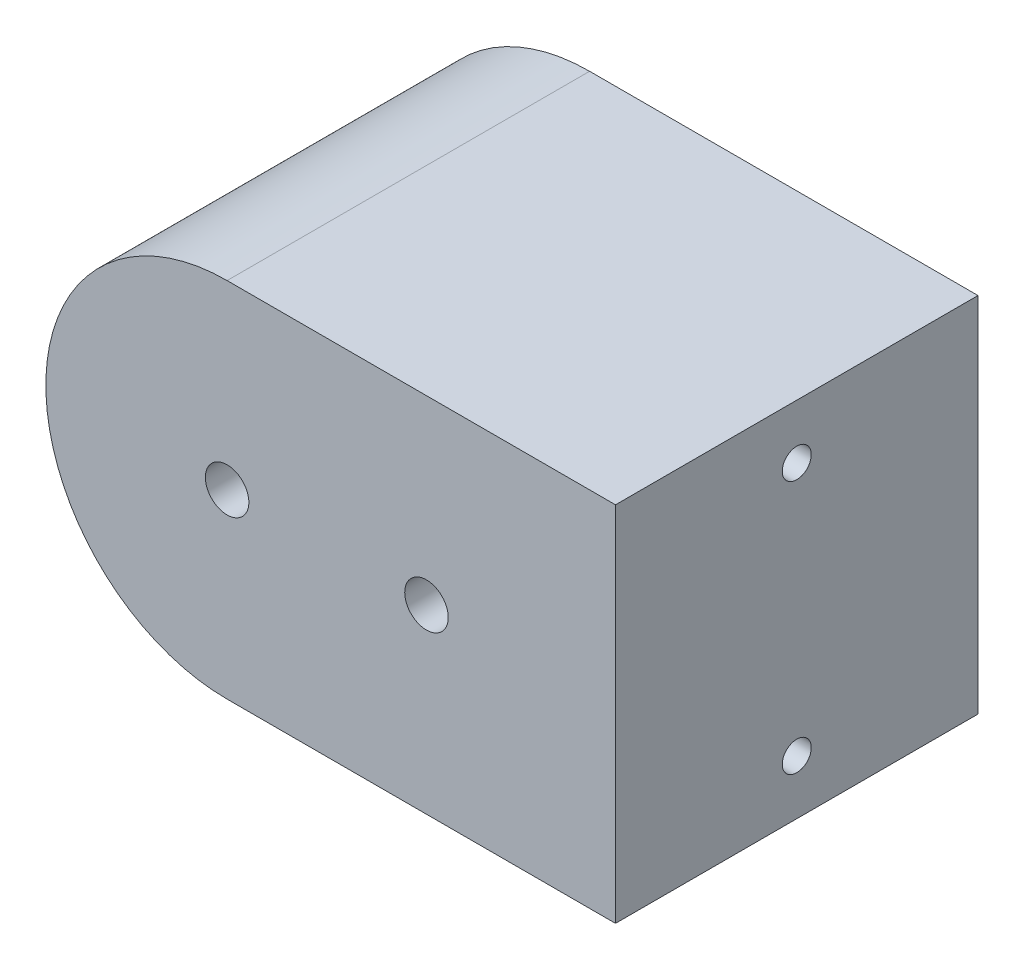
ISO-10303-21;
HEADER;
FILE_DESCRIPTION(('STEP AP214'),'2;1');
FILE_NAME('part.step','',(''),(''),'','','');
FILE_SCHEMA(('AUTOMOTIVE_DESIGN { 1 0 10303 214 1 1 1 1 }'));
ENDSEC;
DATA;
#1=APPLICATION_CONTEXT('core data for automotive mechanical design processes');
#2=APPLICATION_PROTOCOL_DEFINITION('international standard','automotive_design',2000,#1);
#3=PRODUCT_CONTEXT('',#1,'mechanical');
#4=PRODUCT('Part','Part','',(#3));
#5=PRODUCT_RELATED_PRODUCT_CATEGORY('part','',(#4));
#6=PRODUCT_DEFINITION_FORMATION('','',#4);
#7=PRODUCT_DEFINITION_CONTEXT('part definition',#1,'design');
#8=PRODUCT_DEFINITION('design','',#6,#7);
#9=PRODUCT_DEFINITION_SHAPE('','',#8);
#10=(LENGTH_UNIT() NAMED_UNIT(*) SI_UNIT(.MILLI.,.METRE.));
#11=(NAMED_UNIT(*) PLANE_ANGLE_UNIT() SI_UNIT($,.RADIAN.));
#12=(NAMED_UNIT(*) SI_UNIT($,.STERADIAN.) SOLID_ANGLE_UNIT());
#13=UNCERTAINTY_MEASURE_WITH_UNIT(LENGTH_MEASURE(1.E-05),#10,'distance_accuracy_value','');
#14=(GEOMETRIC_REPRESENTATION_CONTEXT(3) GLOBAL_UNCERTAINTY_ASSIGNED_CONTEXT((#13)) GLOBAL_UNIT_ASSIGNED_CONTEXT((#10,
#11,#12)) REPRESENTATION_CONTEXT('',''));
#15=CARTESIAN_POINT('',(0.,0.,0.));
#16=DIRECTION('',(0.,0.,1.));
#17=DIRECTION('',(1.,0.,0.));
#18=AXIS2_PLACEMENT_3D('',#15,#16,#17);
#19=CARTESIAN_POINT('',(22.0895071336129,-15.,85.));
#20=DIRECTION('',(-1.,0.,0.));
#21=DIRECTION('',(0.,0.,1.));
#22=AXIS2_PLACEMENT_3D('',#19,#20,#21);
#23=PLANE('',#22);
#24=CARTESIAN_POINT('',(22.0895071336129,70.,35.));
#25=DIRECTION('',(1.,0.,0.));
#26=DIRECTION('',(0.,0.,-1.));
#27=AXIS2_PLACEMENT_3D('',#24,#25,#26);
#28=CIRCLE('',#27,4.);
#29=CARTESIAN_POINT('',(22.0895071336129,70.,31.));
#30=VERTEX_POINT('',#29);
#31=EDGE_CURVE('E106',#30,#30,#28,.T.);
#32=ORIENTED_EDGE('',*,*,#31,.F.);
#33=EDGE_LOOP('',(#32));
#34=FACE_BOUND('',#33,.T.);
#35=CARTESIAN_POINT('',(22.0895071336129,0.,35.));
#36=DIRECTION('',(1.,0.,0.));
#37=DIRECTION('',(0.,0.,-1.));
#38=AXIS2_PLACEMENT_3D('',#35,#36,#37);
#39=CIRCLE('',#38,4.);
#40=CARTESIAN_POINT('',(22.0895071336129,0.,31.));
#41=VERTEX_POINT('',#40);
#42=EDGE_CURVE('E105',#41,#41,#39,.T.);
#43=ORIENTED_EDGE('',*,*,#42,.F.);
#44=EDGE_LOOP('',(#43));
#45=FACE_BOUND('',#44,.T.);
#46=DIRECTION('',(0.,1.,0.));
#47=VECTOR('',#46,1.);
#48=CARTESIAN_POINT('',(22.0895071336129,-15.,-15.));
#49=LINE('',#48,#47);
#50=CARTESIAN_POINT('',(22.0895071336129,-15.,-15.));
#51=VERTEX_POINT('',#50);
#52=CARTESIAN_POINT('',(22.0895071336129,85.,-15.));
#53=VERTEX_POINT('',#52);
#54=EDGE_CURVE('E135',#51,#53,#49,.T.);
#55=ORIENTED_EDGE('',*,*,#54,.T.);
#56=DIRECTION('',(0.,0.,-1.));
#57=VECTOR('',#56,1.);
#58=CARTESIAN_POINT('',(22.0895071336129,85.,85.));
#59=LINE('',#58,#57);
#60=CARTESIAN_POINT('',(22.0895071336129,85.,85.));
#61=VERTEX_POINT('',#60);
#62=EDGE_CURVE('E11',#61,#53,#59,.T.);
#63=ORIENTED_EDGE('',*,*,#62,.F.);
#64=DIRECTION('',(0.,1.,0.));
#65=VECTOR('',#64,1.);
#66=CARTESIAN_POINT('',(22.0895071336129,-15.,85.));
#67=LINE('',#66,#65);
#68=CARTESIAN_POINT('',(22.0895071336129,-15.,85.));
#69=VERTEX_POINT('',#68);
#70=EDGE_CURVE('E136',#69,#61,#67,.T.);
#71=ORIENTED_EDGE('',*,*,#70,.F.);
#72=DIRECTION('',(0.,0.,-1.));
#73=VECTOR('',#72,1.);
#74=CARTESIAN_POINT('',(22.0895071336129,-15.,85.));
#75=LINE('',#74,#73);
#76=EDGE_CURVE('E146',#69,#51,#75,.T.);
#77=ORIENTED_EDGE('',*,*,#76,.T.);
#78=EDGE_LOOP('',(#55,#63,#71,#77));
#79=FACE_BOUND('',#78,.T.);
#80=ADVANCED_FACE('F39',(#34,#45,#79),#23,.F.);
#81=CARTESIAN_POINT('',(22.0895071336129,85.,85.));
#82=DIRECTION('',(0.,-1.,0.));
#83=DIRECTION('',(1.,0.,0.));
#84=AXIS2_PLACEMENT_3D('',#81,#82,#83);
#85=PLANE('',#84);
#86=DIRECTION('',(-1.,0.,0.));
#87=VECTOR('',#86,1.);
#88=CARTESIAN_POINT('',(22.0895071336129,85.,-15.));
#89=LINE('',#88,#87);
#90=CARTESIAN_POINT('',(-85.0533500092442,85.,-15.));
#91=VERTEX_POINT('',#90);
#92=EDGE_CURVE('E150',#53,#91,#89,.T.);
#93=ORIENTED_EDGE('',*,*,#92,.T.);
#94=DIRECTION('',(0.,0.,-1.));
#95=VECTOR('',#94,1.);
#96=CARTESIAN_POINT('',(-85.0533500092442,85.,85.));
#97=LINE('',#96,#95);
#98=CARTESIAN_POINT('',(-85.0533500092442,85.,85.));
#99=VERTEX_POINT('',#98);
#100=EDGE_CURVE('E48',#99,#91,#97,.T.);
#101=ORIENTED_EDGE('',*,*,#100,.F.);
#102=DIRECTION('',(-1.,0.,0.));
#103=VECTOR('',#102,1.);
#104=CARTESIAN_POINT('',(22.0895071336129,85.,85.));
#105=LINE('',#104,#103);
#106=EDGE_CURVE('E87',#61,#99,#105,.T.);
#107=ORIENTED_EDGE('',*,*,#106,.F.);
#108=ORIENTED_EDGE('',*,*,#62,.T.);
#109=EDGE_LOOP('',(#93,#101,#107,#108));
#110=FACE_BOUND('',#109,.T.);
#111=ADVANCED_FACE('F180',(#110),#85,.F.);
#112=CARTESIAN_POINT('',(-85.0533500092442,35.,85.));
#113=DIRECTION('',(0.,0.,-1.));
#114=DIRECTION('',(-1.,0.,0.));
#115=AXIS2_PLACEMENT_3D('',#112,#113,#114);
#116=CYLINDRICAL_SURFACE('',#115,50.);
#117=CARTESIAN_POINT('',(-85.0533500092442,35.,-15.));
#118=DIRECTION('',(0.,0.,1.));
#119=DIRECTION('',(-1.,0.,0.));
#120=AXIS2_PLACEMENT_3D('',#117,#118,#119);
#121=CIRCLE('',#120,50.);
#122=CARTESIAN_POINT('',(-85.0533500092442,-15.,-15.));
#123=VERTEX_POINT('',#122);
#124=EDGE_CURVE('E74',#91,#123,#121,.T.);
#125=ORIENTED_EDGE('',*,*,#124,.T.);
#126=DIRECTION('',(0.,0.,-1.));
#127=VECTOR('',#126,1.);
#128=CARTESIAN_POINT('',(-85.0533500092442,-15.,85.));
#129=LINE('',#128,#127);
#130=CARTESIAN_POINT('',(-85.0533500092442,-15.,85.));
#131=VERTEX_POINT('',#130);
#132=EDGE_CURVE('E159',#131,#123,#129,.T.);
#133=ORIENTED_EDGE('',*,*,#132,.F.);
#134=CARTESIAN_POINT('',(-85.0533500092442,35.,85.));
#135=DIRECTION('',(0.,0.,1.));
#136=DIRECTION('',(-1.,0.,0.));
#137=AXIS2_PLACEMENT_3D('',#134,#135,#136);
#138=CIRCLE('',#137,50.);
#139=EDGE_CURVE('E141',#99,#131,#138,.T.);
#140=ORIENTED_EDGE('',*,*,#139,.F.);
#141=ORIENTED_EDGE('',*,*,#100,.T.);
#142=EDGE_LOOP('',(#125,#133,#140,#141));
#143=FACE_BOUND('',#142,.T.);
#144=ADVANCED_FACE('F163',(#143),#116,.T.);
#145=CARTESIAN_POINT('',(22.0895071336129,-15.,85.));
#146=DIRECTION('',(0.,1.,0.));
#147=DIRECTION('',(-1.,0.,0.));
#148=AXIS2_PLACEMENT_3D('',#145,#146,#147);
#149=PLANE('',#148);
#150=DIRECTION('',(1.,0.,0.));
#151=VECTOR('',#150,1.);
#152=CARTESIAN_POINT('',(22.0895071336129,-15.,-15.));
#153=LINE('',#152,#151);
#154=EDGE_CURVE('E80',#123,#51,#153,.T.);
#155=ORIENTED_EDGE('',*,*,#154,.T.);
#156=ORIENTED_EDGE('',*,*,#76,.F.);
#157=DIRECTION('',(1.,0.,0.));
#158=VECTOR('',#157,1.);
#159=CARTESIAN_POINT('',(22.0895071336129,-15.,85.));
#160=LINE('',#159,#158);
#161=EDGE_CURVE('E56',#131,#69,#160,.T.);
#162=ORIENTED_EDGE('',*,*,#161,.F.);
#163=ORIENTED_EDGE('',*,*,#132,.T.);
#164=EDGE_LOOP('',(#155,#156,#162,#163));
#165=FACE_BOUND('',#164,.T.);
#166=ADVANCED_FACE('F170',(#165),#149,.F.);
#167=CARTESIAN_POINT('',(-85.0533500092442,35.,85.));
#168=DIRECTION('',(0.,0.,-1.));
#169=DIRECTION('',(-1.,0.,0.));
#170=AXIS2_PLACEMENT_3D('',#167,#168,#169);
#171=PLANE('',#170);
#172=CARTESIAN_POINT('',(-30.0533500092442,35.,85.));
#173=DIRECTION('',(0.,0.,-1.));
#174=DIRECTION('',(-1.,0.,0.));
#175=AXIS2_PLACEMENT_3D('',#172,#173,#174);
#176=CIRCLE('',#175,5.99999999999998);
#177=CARTESIAN_POINT('',(-36.0533500092442,35.,85.));
#178=VERTEX_POINT('',#177);
#179=EDGE_CURVE('E123',#178,#178,#176,.T.);
#180=ORIENTED_EDGE('',*,*,#179,.T.);
#181=EDGE_LOOP('',(#180));
#182=FACE_BOUND('',#181,.T.);
#183=CARTESIAN_POINT('',(-85.0533500092442,35.,85.));
#184=DIRECTION('',(0.,0.,-1.));
#185=DIRECTION('',(-1.,0.,0.));
#186=AXIS2_PLACEMENT_3D('',#183,#184,#185);
#187=CIRCLE('',#186,5.99999999999998);
#188=CARTESIAN_POINT('',(-91.0533500092442,35.,85.));
#189=VERTEX_POINT('',#188);
#190=EDGE_CURVE('E131',#189,#189,#187,.T.);
#191=ORIENTED_EDGE('',*,*,#190,.T.);
#192=EDGE_LOOP('',(#191));
#193=FACE_BOUND('',#192,.T.);
#194=ORIENTED_EDGE('',*,*,#70,.T.);
#195=ORIENTED_EDGE('',*,*,#106,.T.);
#196=ORIENTED_EDGE('',*,*,#139,.T.);
#197=ORIENTED_EDGE('',*,*,#161,.T.);
#198=EDGE_LOOP('',(#194,#195,#196,#197));
#199=FACE_BOUND('',#198,.T.);
#200=ADVANCED_FACE('F172',(#182,#193,#199),#171,.F.);
#201=CARTESIAN_POINT('',(-85.0533500092442,35.,-15.));
#202=DIRECTION('',(0.,0.,-1.));
#203=DIRECTION('',(-1.,0.,0.));
#204=AXIS2_PLACEMENT_3D('',#201,#202,#203);
#205=PLANE('',#204);
#206=CARTESIAN_POINT('',(-30.0533500092442,35.,-15.));
#207=DIRECTION('',(0.,0.,-1.));
#208=DIRECTION('',(-1.,0.,0.));
#209=AXIS2_PLACEMENT_3D('',#206,#207,#208);
#210=CIRCLE('',#209,5.99999999999999);
#211=CARTESIAN_POINT('',(-36.0533500092442,35.,-15.));
#212=VERTEX_POINT('',#211);
#213=EDGE_CURVE('E119',#212,#212,#210,.T.);
#214=ORIENTED_EDGE('',*,*,#213,.F.);
#215=EDGE_LOOP('',(#214));
#216=FACE_BOUND('',#215,.T.);
#217=CARTESIAN_POINT('',(-85.0533500092442,35.,-15.));
#218=DIRECTION('',(0.,0.,-1.));
#219=DIRECTION('',(-1.,0.,0.));
#220=AXIS2_PLACEMENT_3D('',#217,#218,#219);
#221=CIRCLE('',#220,5.99999999999999);
#222=CARTESIAN_POINT('',(-91.0533500092442,35.,-15.));
#223=VERTEX_POINT('',#222);
#224=EDGE_CURVE('E127',#223,#223,#221,.T.);
#225=ORIENTED_EDGE('',*,*,#224,.F.);
#226=EDGE_LOOP('',(#225));
#227=FACE_BOUND('',#226,.T.);
#228=ORIENTED_EDGE('',*,*,#54,.F.);
#229=ORIENTED_EDGE('',*,*,#154,.F.);
#230=ORIENTED_EDGE('',*,*,#124,.F.);
#231=ORIENTED_EDGE('',*,*,#92,.F.);
#232=EDGE_LOOP('',(#228,#229,#230,#231));
#233=FACE_BOUND('',#232,.T.);
#234=ADVANCED_FACE('F166',(#216,#227,#233),#205,.T.);
#235=CARTESIAN_POINT('',(-85.0533500092442,35.,-15.));
#236=DIRECTION('',(0.,0.,-1.));
#237=DIRECTION('',(-1.,0.,0.));
#238=AXIS2_PLACEMENT_3D('',#235,#236,#237);
#239=CYLINDRICAL_SURFACE('',#238,5.99999999999998);
#240=ORIENTED_EDGE('',*,*,#190,.F.);
#241=EDGE_LOOP('',(#240));
#242=FACE_BOUND('',#241,.T.);
#243=ORIENTED_EDGE('',*,*,#224,.T.);
#244=EDGE_LOOP('',(#243));
#245=FACE_BOUND('',#244,.T.);
#246=ADVANCED_FACE('F207',(#242,#245),#239,.F.);
#247=CARTESIAN_POINT('',(-30.0533500092442,35.,-15.));
#248=DIRECTION('',(0.,0.,-1.));
#249=DIRECTION('',(-1.,0.,0.));
#250=AXIS2_PLACEMENT_3D('',#247,#248,#249);
#251=CYLINDRICAL_SURFACE('',#250,5.99999999999998);
#252=ORIENTED_EDGE('',*,*,#179,.F.);
#253=EDGE_LOOP('',(#252));
#254=FACE_BOUND('',#253,.T.);
#255=ORIENTED_EDGE('',*,*,#213,.T.);
#256=EDGE_LOOP('',(#255));
#257=FACE_BOUND('',#256,.T.);
#258=ADVANCED_FACE('F199',(#254,#257),#251,.F.);
#259=CARTESIAN_POINT('',(2.08950713361291,0.,35.));
#260=DIRECTION('',(1.,0.,0.));
#261=DIRECTION('',(0.,0.,-1.));
#262=AXIS2_PLACEMENT_3D('',#259,#260,#261);
#263=CONICAL_SURFACE('',#262,3.99999999999999,1.02974425867665);
#264=CARTESIAN_POINT('',(-0.313935342497327,0.,35.));
#265=VERTEX_POINT('',#264);
#266=VERTEX_LOOP('',#265);
#267=FACE_BOUND('',#266,.T.);
#268=CARTESIAN_POINT('',(2.08950713361291,0.,35.));
#269=DIRECTION('',(1.,0.,0.));
#270=DIRECTION('',(0.,0.,-1.));
#271=AXIS2_PLACEMENT_3D('',#268,#269,#270);
#272=CIRCLE('',#271,3.99999999999999);
#273=CARTESIAN_POINT('',(2.08950713361291,0.,31.));
#274=VERTEX_POINT('',#273);
#275=EDGE_CURVE('E111',#274,#274,#272,.T.);
#276=ORIENTED_EDGE('',*,*,#275,.T.);
#277=EDGE_LOOP('',(#276));
#278=FACE_BOUND('',#277,.T.);
#279=ADVANCED_FACE('F193',(#267,#278),#263,.F.);
#280=CARTESIAN_POINT('',(22.0895071336129,0.,35.));
#281=DIRECTION('',(1.,0.,0.));
#282=DIRECTION('',(0.,0.,-1.));
#283=AXIS2_PLACEMENT_3D('',#280,#281,#282);
#284=CYLINDRICAL_SURFACE('',#283,4.);
#285=ORIENTED_EDGE('',*,*,#275,.F.);
#286=EDGE_LOOP('',(#285));
#287=FACE_BOUND('',#286,.T.);
#288=ORIENTED_EDGE('',*,*,#42,.T.);
#289=EDGE_LOOP('',(#288));
#290=FACE_BOUND('',#289,.T.);
#291=ADVANCED_FACE('F98',(#287,#290),#284,.F.);
#292=CARTESIAN_POINT('',(2.08950713361291,70.,35.));
#293=DIRECTION('',(1.,0.,0.));
#294=DIRECTION('',(0.,0.,-1.));
#295=AXIS2_PLACEMENT_3D('',#292,#293,#294);
#296=CONICAL_SURFACE('',#295,3.99999999999999,1.02974425867665);
#297=CARTESIAN_POINT('',(-0.313935342497327,70.,35.));
#298=VERTEX_POINT('',#297);
#299=VERTEX_LOOP('',#298);
#300=FACE_BOUND('',#299,.T.);
#301=CARTESIAN_POINT('',(2.08950713361291,70.,35.));
#302=DIRECTION('',(1.,0.,0.));
#303=DIRECTION('',(0.,0.,-1.));
#304=AXIS2_PLACEMENT_3D('',#301,#302,#303);
#305=CIRCLE('',#304,3.99999999999999);
#306=CARTESIAN_POINT('',(2.08950713361291,70.,31.));
#307=VERTEX_POINT('',#306);
#308=EDGE_CURVE('E102',#307,#307,#305,.T.);
#309=ORIENTED_EDGE('',*,*,#308,.T.);
#310=EDGE_LOOP('',(#309));
#311=FACE_BOUND('',#310,.T.);
#312=ADVANCED_FACE('F94',(#300,#311),#296,.F.);
#313=CARTESIAN_POINT('',(22.0895071336129,70.,35.));
#314=DIRECTION('',(1.,0.,0.));
#315=DIRECTION('',(0.,0.,-1.));
#316=AXIS2_PLACEMENT_3D('',#313,#314,#315);
#317=CYLINDRICAL_SURFACE('',#316,4.);
#318=ORIENTED_EDGE('',*,*,#308,.F.);
#319=EDGE_LOOP('',(#318));
#320=FACE_BOUND('',#319,.T.);
#321=ORIENTED_EDGE('',*,*,#31,.T.);
#322=EDGE_LOOP('',(#321));
#323=FACE_BOUND('',#322,.T.);
#324=ADVANCED_FACE('F97',(#320,#323),#317,.F.);
#325=CLOSED_SHELL('',(#80,#111,#144,#166,#200,#234,#246,#258,#279,#291,#312,#324));
#326=MANIFOLD_SOLID_BREP('B2',#325);
#327=ADVANCED_BREP_SHAPE_REPRESENTATION('',(#18,#326),#14);
#328=SHAPE_DEFINITION_REPRESENTATION(#9,#327);
ENDSEC;
END-ISO-10303-21;
